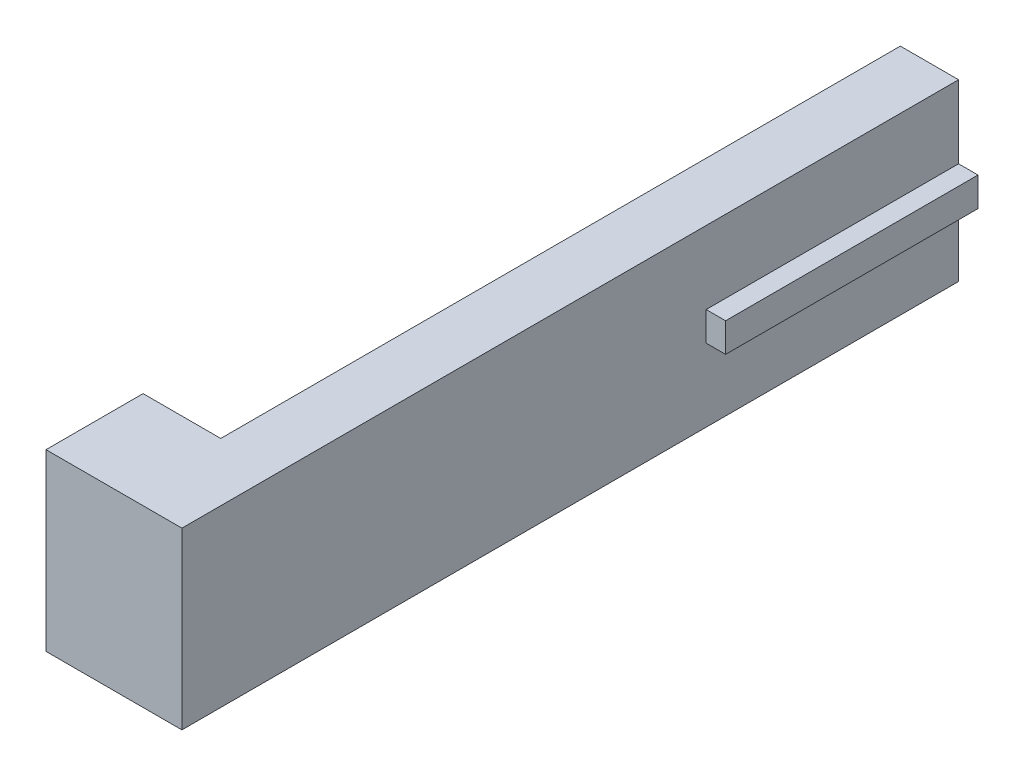
ISO-10303-21;
HEADER;
FILE_DESCRIPTION(('STEP AP214'),'2;1');
FILE_NAME('part.step','',(''),(''),'','','');
FILE_SCHEMA(('AUTOMOTIVE_DESIGN { 1 0 10303 214 1 1 1 1 }'));
ENDSEC;
DATA;
#1=APPLICATION_CONTEXT('core data for automotive mechanical design processes');
#2=APPLICATION_PROTOCOL_DEFINITION('international standard','automotive_design',2000,#1);
#3=PRODUCT_CONTEXT('',#1,'mechanical');
#4=PRODUCT('Part','Part','',(#3));
#5=PRODUCT_RELATED_PRODUCT_CATEGORY('part','',(#4));
#6=PRODUCT_DEFINITION_FORMATION('','',#4);
#7=PRODUCT_DEFINITION_CONTEXT('part definition',#1,'design');
#8=PRODUCT_DEFINITION('design','',#6,#7);
#9=PRODUCT_DEFINITION_SHAPE('','',#8);
#10=(LENGTH_UNIT() NAMED_UNIT(*) SI_UNIT(.MILLI.,.METRE.));
#11=(NAMED_UNIT(*) PLANE_ANGLE_UNIT() SI_UNIT($,.RADIAN.));
#12=(NAMED_UNIT(*) SI_UNIT($,.STERADIAN.) SOLID_ANGLE_UNIT());
#13=UNCERTAINTY_MEASURE_WITH_UNIT(LENGTH_MEASURE(1.E-05),#10,'distance_accuracy_value','');
#14=(GEOMETRIC_REPRESENTATION_CONTEXT(3) GLOBAL_UNCERTAINTY_ASSIGNED_CONTEXT((#13)) GLOBAL_UNIT_ASSIGNED_CONTEXT((#10,
#11,#12)) REPRESENTATION_CONTEXT('',''));
#15=CARTESIAN_POINT('',(0.,0.,0.));
#16=DIRECTION('',(0.,0.,1.));
#17=DIRECTION('',(1.,0.,0.));
#18=AXIS2_PLACEMENT_3D('',#15,#16,#17);
#19=CARTESIAN_POINT('',(-15.,-22.5,200.));
#20=DIRECTION('',(1.,0.,0.));
#21=DIRECTION('',(0.,1.,0.));
#22=AXIS2_PLACEMENT_3D('',#19,#20,#21);
#23=PLANE('',#22);
#24=DIRECTION('',(0.,1.,0.));
#25=VECTOR('',#24,1.);
#26=CARTESIAN_POINT('',(-15.,-22.5,175.));
#27=LINE('',#26,#25);
#28=CARTESIAN_POINT('',(-15.,-22.5,175.));
#29=VERTEX_POINT('',#28);
#30=CARTESIAN_POINT('',(-15.,-3.75000000000001,175.));
#31=VERTEX_POINT('',#30);
#32=EDGE_CURVE('E238',#29,#31,#27,.T.);
#33=ORIENTED_EDGE('',*,*,#32,.T.);
#34=DIRECTION('',(0.,0.,-1.));
#35=VECTOR('',#34,1.);
#36=CARTESIAN_POINT('',(-15.,-3.75,184.01387818866));
#37=LINE('',#36,#35);
#38=CARTESIAN_POINT('',(-15.,-3.75,0.));
#39=VERTEX_POINT('',#38);
#40=EDGE_CURVE('E54',#31,#39,#37,.T.);
#41=ORIENTED_EDGE('',*,*,#40,.T.);
#42=DIRECTION('',(0.,-1.,0.));
#43=VECTOR('',#42,1.);
#44=CARTESIAN_POINT('',(-15.,-22.5,0.));
#45=LINE('',#44,#43);
#46=CARTESIAN_POINT('',(-15.,-22.5,0.));
#47=VERTEX_POINT('',#46);
#48=EDGE_CURVE('E164',#39,#47,#45,.T.);
#49=ORIENTED_EDGE('',*,*,#48,.T.);
#50=DIRECTION('',(0.,0.,-1.));
#51=VECTOR('',#50,1.);
#52=CARTESIAN_POINT('',(-15.,-22.5,200.));
#53=LINE('',#52,#51);
#54=EDGE_CURVE('E196',#29,#47,#53,.T.);
#55=ORIENTED_EDGE('',*,*,#54,.F.);
#56=EDGE_LOOP('',(#33,#41,#49,#55));
#57=FACE_BOUND('',#56,.T.);
#58=ADVANCED_FACE('F39',(#57),#23,.F.);
#59=CARTESIAN_POINT('',(-15.,22.5,200.));
#60=DIRECTION('',(0.,-1.,0.));
#61=DIRECTION('',(0.,0.,-1.));
#62=AXIS2_PLACEMENT_3D('',#59,#60,#61);
#63=PLANE('',#62);
#64=DIRECTION('',(-1.,0.,0.));
#65=VECTOR('',#64,1.);
#66=CARTESIAN_POINT('',(-15.,22.5,0.));
#67=LINE('',#66,#65);
#68=CARTESIAN_POINT('',(0.,22.5,0.));
#69=VERTEX_POINT('',#68);
#70=CARTESIAN_POINT('',(-15.,22.5,0.));
#71=VERTEX_POINT('',#70);
#72=EDGE_CURVE('E168',#69,#71,#67,.T.);
#73=ORIENTED_EDGE('',*,*,#72,.T.);
#74=DIRECTION('',(0.,0.,-1.));
#75=VECTOR('',#74,1.);
#76=CARTESIAN_POINT('',(-15.,22.5,200.));
#77=LINE('',#76,#75);
#78=CARTESIAN_POINT('',(-15.,22.5,175.));
#79=VERTEX_POINT('',#78);
#80=EDGE_CURVE('E47',#79,#71,#77,.T.);
#81=ORIENTED_EDGE('',*,*,#80,.F.);
#82=DIRECTION('',(-1.,0.,0.));
#83=VECTOR('',#82,1.);
#84=CARTESIAN_POINT('',(-35.,22.5,175.));
#85=LINE('',#84,#83);
#86=CARTESIAN_POINT('',(-35.,22.5,175.));
#87=VERTEX_POINT('',#86);
#88=EDGE_CURVE('E428',#79,#87,#85,.T.);
#89=ORIENTED_EDGE('',*,*,#88,.T.);
#90=DIRECTION('',(0.,0.,1.));
#91=VECTOR('',#90,1.);
#92=CARTESIAN_POINT('',(-35.,22.5,175.));
#93=LINE('',#92,#91);
#94=CARTESIAN_POINT('',(-35.,22.5,200.));
#95=VERTEX_POINT('',#94);
#96=EDGE_CURVE('E233',#87,#95,#93,.T.);
#97=ORIENTED_EDGE('',*,*,#96,.T.);
#98=DIRECTION('',(-1.,0.,0.));
#99=VECTOR('',#98,1.);
#100=CARTESIAN_POINT('',(-15.,22.5,200.));
#101=LINE('',#100,#99);
#102=CARTESIAN_POINT('',(0.,22.5,200.));
#103=VERTEX_POINT('',#102);
#104=EDGE_CURVE('E224',#103,#95,#101,.T.);
#105=ORIENTED_EDGE('',*,*,#104,.F.);
#106=DIRECTION('',(0.,0.,-1.));
#107=VECTOR('',#106,1.);
#108=CARTESIAN_POINT('',(0.,22.5,200.));
#109=LINE('',#108,#107);
#110=EDGE_CURVE('E11',#103,#69,#109,.T.);
#111=ORIENTED_EDGE('',*,*,#110,.T.);
#112=EDGE_LOOP('',(#73,#81,#89,#97,#105,#111));
#113=FACE_BOUND('',#112,.T.);
#114=ADVANCED_FACE('F41',(#113),#63,.F.);
#115=CARTESIAN_POINT('',(-15.,3.75,0.));
#116=VERTEX_POINT('',#115);
#117=EDGE_CURVE('E156',#71,#116,#45,.T.);
#118=ORIENTED_EDGE('',*,*,#117,.T.);
#119=DIRECTION('',(0.,0.,-1.));
#120=VECTOR('',#119,1.);
#121=CARTESIAN_POINT('',(-15.,3.75,184.01387818866));
#122=LINE('',#121,#120);
#123=CARTESIAN_POINT('',(-15.,3.75,175.));
#124=VERTEX_POINT('',#123);
#125=EDGE_CURVE('E140',#124,#116,#122,.T.);
#126=ORIENTED_EDGE('',*,*,#125,.F.);
#127=EDGE_CURVE('E62',#124,#79,#27,.T.);
#128=ORIENTED_EDGE('',*,*,#127,.T.);
#129=ORIENTED_EDGE('',*,*,#80,.T.);
#130=EDGE_LOOP('',(#118,#126,#128,#129));
#131=FACE_BOUND('',#130,.T.);
#132=ADVANCED_FACE('F160',(#131),#23,.F.);
#133=CARTESIAN_POINT('',(-15.,-22.5,200.));
#134=DIRECTION('',(0.,1.,0.));
#135=DIRECTION('',(-1.,0.,0.));
#136=AXIS2_PLACEMENT_3D('',#133,#134,#135);
#137=PLANE('',#136);
#138=DIRECTION('',(1.,0.,0.));
#139=VECTOR('',#138,1.);
#140=CARTESIAN_POINT('',(-15.,-22.5,0.));
#141=LINE('',#140,#139);
#142=CARTESIAN_POINT('',(0.,-22.5,0.));
#143=VERTEX_POINT('',#142);
#144=EDGE_CURVE('E163',#47,#143,#141,.T.);
#145=ORIENTED_EDGE('',*,*,#144,.T.);
#146=DIRECTION('',(0.,0.,-1.));
#147=VECTOR('',#146,1.);
#148=CARTESIAN_POINT('',(0.,-22.5,200.));
#149=LINE('',#148,#147);
#150=CARTESIAN_POINT('',(0.,-22.5,200.));
#151=VERTEX_POINT('',#150);
#152=EDGE_CURVE('E193',#151,#143,#149,.T.);
#153=ORIENTED_EDGE('',*,*,#152,.F.);
#154=DIRECTION('',(1.,0.,0.));
#155=VECTOR('',#154,1.);
#156=CARTESIAN_POINT('',(-15.,-22.5,200.));
#157=LINE('',#156,#155);
#158=CARTESIAN_POINT('',(-35.,-22.5,200.));
#159=VERTEX_POINT('',#158);
#160=EDGE_CURVE('E187',#159,#151,#157,.T.);
#161=ORIENTED_EDGE('',*,*,#160,.F.);
#162=DIRECTION('',(0.,0.,1.));
#163=VECTOR('',#162,1.);
#164=CARTESIAN_POINT('',(-35.,-22.5,175.));
#165=LINE('',#164,#163);
#166=CARTESIAN_POINT('',(-35.,-22.5,175.));
#167=VERTEX_POINT('',#166);
#168=EDGE_CURVE('E220',#167,#159,#165,.T.);
#169=ORIENTED_EDGE('',*,*,#168,.F.);
#170=DIRECTION('',(1.,0.,0.));
#171=VECTOR('',#170,1.);
#172=CARTESIAN_POINT('',(-35.,-22.5,175.));
#173=LINE('',#172,#171);
#174=EDGE_CURVE('E205',#167,#29,#173,.T.);
#175=ORIENTED_EDGE('',*,*,#174,.T.);
#176=ORIENTED_EDGE('',*,*,#54,.T.);
#177=EDGE_LOOP('',(#145,#153,#161,#169,#175,#176));
#178=FACE_BOUND('',#177,.T.);
#179=ADVANCED_FACE('F202',(#178),#137,.F.);
#180=CARTESIAN_POINT('',(0.,-22.5,200.));
#181=DIRECTION('',(-1.,0.,0.));
#182=DIRECTION('',(0.,-1.,0.));
#183=AXIS2_PLACEMENT_3D('',#180,#181,#182);
#184=PLANE('',#183);
#185=DIRECTION('',(0.,1.,0.));
#186=VECTOR('',#185,1.);
#187=CARTESIAN_POINT('',(0.,-22.5,0.));
#188=LINE('',#187,#186);
#189=CARTESIAN_POINT('',(0.,-3.75,0.));
#190=VERTEX_POINT('',#189);
#191=EDGE_CURVE('E166',#143,#190,#188,.T.);
#192=ORIENTED_EDGE('',*,*,#191,.T.);
#193=DIRECTION('',(0.,0.,-1.));
#194=VECTOR('',#193,1.);
#195=CARTESIAN_POINT('',(0.,-3.75,200.));
#196=LINE('',#195,#194);
#197=CARTESIAN_POINT('',(0.,-3.75,65.));
#198=VERTEX_POINT('',#197);
#199=EDGE_CURVE('E191',#198,#190,#196,.T.);
#200=ORIENTED_EDGE('',*,*,#199,.F.);
#201=DIRECTION('',(0.,1.,0.));
#202=VECTOR('',#201,1.);
#203=CARTESIAN_POINT('',(0.,3.75,65.));
#204=LINE('',#203,#202);
#205=CARTESIAN_POINT('',(0.,3.75,65.));
#206=VERTEX_POINT('',#205);
#207=EDGE_CURVE('E248',#198,#206,#204,.T.);
#208=ORIENTED_EDGE('',*,*,#207,.T.);
#209=DIRECTION('',(0.,0.,-1.));
#210=VECTOR('',#209,1.);
#211=CARTESIAN_POINT('',(0.,3.75,200.));
#212=LINE('',#211,#210);
#213=CARTESIAN_POINT('',(0.,3.75,0.));
#214=VERTEX_POINT('',#213);
#215=EDGE_CURVE('E184',#206,#214,#212,.T.);
#216=ORIENTED_EDGE('',*,*,#215,.T.);
#217=DIRECTION('',(0.,1.,0.));
#218=VECTOR('',#217,1.);
#219=CARTESIAN_POINT('',(0.,3.75,0.));
#220=LINE('',#219,#218);
#221=EDGE_CURVE('E253',#214,#69,#220,.T.);
#222=ORIENTED_EDGE('',*,*,#221,.T.);
#223=ORIENTED_EDGE('',*,*,#110,.F.);
#224=DIRECTION('',(0.,1.,0.));
#225=VECTOR('',#224,1.);
#226=CARTESIAN_POINT('',(0.,3.75,200.));
#227=LINE('',#226,#225);
#228=EDGE_CURVE('E183',#151,#103,#227,.T.);
#229=ORIENTED_EDGE('',*,*,#228,.F.);
#230=ORIENTED_EDGE('',*,*,#152,.T.);
#231=EDGE_LOOP('',(#192,#200,#208,#216,#222,#223,#229,#230));
#232=FACE_BOUND('',#231,.T.);
#233=ADVANCED_FACE('F214',(#232),#184,.F.);
#234=CARTESIAN_POINT('',(5.,-3.75,200.));
#235=DIRECTION('',(0.,1.,0.));
#236=DIRECTION('',(0.,0.,1.));
#237=AXIS2_PLACEMENT_3D('',#234,#235,#236);
#238=PLANE('',#237);
#239=DIRECTION('',(0.,0.,-1.));
#240=VECTOR('',#239,1.);
#241=CARTESIAN_POINT('',(5.,-3.75,200.));
#242=LINE('',#241,#240);
#243=CARTESIAN_POINT('',(5.,-3.75,65.));
#244=VERTEX_POINT('',#243);
#245=CARTESIAN_POINT('',(5.,-3.75,0.));
#246=VERTEX_POINT('',#245);
#247=EDGE_CURVE('E189',#244,#246,#242,.T.);
#248=ORIENTED_EDGE('',*,*,#247,.F.);
#249=DIRECTION('',(1.,0.,0.));
#250=VECTOR('',#249,1.);
#251=CARTESIAN_POINT('',(-135.2081728299,-3.75,65.));
#252=LINE('',#251,#250);
#253=EDGE_CURVE('E247',#198,#244,#252,.T.);
#254=ORIENTED_EDGE('',*,*,#253,.F.);
#255=ORIENTED_EDGE('',*,*,#199,.T.);
#256=DIRECTION('',(1.,0.,0.));
#257=VECTOR('',#256,1.);
#258=CARTESIAN_POINT('',(5.,-3.75,0.));
#259=LINE('',#258,#257);
#260=EDGE_CURVE('E174',#190,#246,#259,.T.);
#261=ORIENTED_EDGE('',*,*,#260,.T.);
#262=EDGE_LOOP('',(#248,#254,#255,#261));
#263=FACE_BOUND('',#262,.T.);
#264=ADVANCED_FACE('F271',(#263),#238,.F.);
#265=CARTESIAN_POINT('',(5.,-3.75,200.));
#266=DIRECTION('',(-1.,0.,0.));
#267=DIRECTION('',(0.,0.,1.));
#268=AXIS2_PLACEMENT_3D('',#265,#266,#267);
#269=PLANE('',#268);
#270=DIRECTION('',(0.,0.,-1.));
#271=VECTOR('',#270,1.);
#272=CARTESIAN_POINT('',(5.,3.75,200.));
#273=LINE('',#272,#271);
#274=CARTESIAN_POINT('',(5.,3.75,65.));
#275=VERTEX_POINT('',#274);
#276=CARTESIAN_POINT('',(5.,3.75,0.));
#277=VERTEX_POINT('',#276);
#278=EDGE_CURVE('E186',#275,#277,#273,.T.);
#279=ORIENTED_EDGE('',*,*,#278,.F.);
#280=DIRECTION('',(0.,1.,0.));
#281=VECTOR('',#280,1.);
#282=CARTESIAN_POINT('',(5.,3.75,65.));
#283=LINE('',#282,#281);
#284=EDGE_CURVE('E232',#244,#275,#283,.T.);
#285=ORIENTED_EDGE('',*,*,#284,.F.);
#286=ORIENTED_EDGE('',*,*,#247,.T.);
#287=DIRECTION('',(0.,1.,0.));
#288=VECTOR('',#287,1.);
#289=CARTESIAN_POINT('',(5.,-3.75,0.));
#290=LINE('',#289,#288);
#291=EDGE_CURVE('E177',#246,#277,#290,.T.);
#292=ORIENTED_EDGE('',*,*,#291,.T.);
#293=EDGE_LOOP('',(#279,#285,#286,#292));
#294=FACE_BOUND('',#293,.T.);
#295=ADVANCED_FACE('F267',(#294),#269,.F.);
#296=CARTESIAN_POINT('',(5.,3.75,200.));
#297=DIRECTION('',(0.,-1.,0.));
#298=DIRECTION('',(0.,0.,-1.));
#299=AXIS2_PLACEMENT_3D('',#296,#297,#298);
#300=PLANE('',#299);
#301=ORIENTED_EDGE('',*,*,#215,.F.);
#302=DIRECTION('',(1.,0.,0.));
#303=VECTOR('',#302,1.);
#304=CARTESIAN_POINT('',(-135.2081728299,3.75,65.));
#305=LINE('',#304,#303);
#306=EDGE_CURVE('E250',#206,#275,#305,.T.);
#307=ORIENTED_EDGE('',*,*,#306,.T.);
#308=ORIENTED_EDGE('',*,*,#278,.T.);
#309=DIRECTION('',(-1.,0.,0.));
#310=VECTOR('',#309,1.);
#311=CARTESIAN_POINT('',(5.,3.75,0.));
#312=LINE('',#311,#310);
#313=EDGE_CURVE('E180',#277,#214,#312,.T.);
#314=ORIENTED_EDGE('',*,*,#313,.T.);
#315=EDGE_LOOP('',(#301,#307,#308,#314));
#316=FACE_BOUND('',#315,.T.);
#317=ADVANCED_FACE('F263',(#316),#300,.F.);
#318=CARTESIAN_POINT('',(0.,0.,200.));
#319=DIRECTION('',(0.,0.,-1.));
#320=DIRECTION('',(-1.,0.,0.));
#321=AXIS2_PLACEMENT_3D('',#318,#319,#320);
#322=PLANE('',#321);
#323=ORIENTED_EDGE('',*,*,#160,.T.);
#324=ORIENTED_EDGE('',*,*,#228,.T.);
#325=ORIENTED_EDGE('',*,*,#104,.T.);
#326=DIRECTION('',(0.,-1.,0.));
#327=VECTOR('',#326,1.);
#328=CARTESIAN_POINT('',(-35.,-22.5,200.));
#329=LINE('',#328,#327);
#330=EDGE_CURVE('E229',#95,#159,#329,.T.);
#331=ORIENTED_EDGE('',*,*,#330,.T.);
#332=EDGE_LOOP('',(#323,#324,#325,#331));
#333=FACE_BOUND('',#332,.T.);
#334=ADVANCED_FACE('F235',(#333),#322,.F.);
#335=CARTESIAN_POINT('',(0.,0.,0.));
#336=DIRECTION('',(0.,0.,-1.));
#337=DIRECTION('',(-1.,0.,0.));
#338=AXIS2_PLACEMENT_3D('',#335,#336,#337);
#339=PLANE('',#338);
#340=DIRECTION('',(-1.,0.,0.));
#341=VECTOR('',#340,1.);
#342=CARTESIAN_POINT('',(-10.,-3.75,0.));
#343=LINE('',#342,#341);
#344=CARTESIAN_POINT('',(-10.,-3.75,0.));
#345=VERTEX_POINT('',#344);
#346=EDGE_CURVE('E150',#345,#39,#343,.T.);
#347=ORIENTED_EDGE('',*,*,#346,.F.);
#348=DIRECTION('',(0.,-1.,0.));
#349=VECTOR('',#348,1.);
#350=CARTESIAN_POINT('',(-10.,-3.75,0.));
#351=LINE('',#350,#349);
#352=CARTESIAN_POINT('',(-10.,3.75,0.));
#353=VERTEX_POINT('',#352);
#354=EDGE_CURVE('E158',#353,#345,#351,.T.);
#355=ORIENTED_EDGE('',*,*,#354,.F.);
#356=DIRECTION('',(1.,0.,0.));
#357=VECTOR('',#356,1.);
#358=CARTESIAN_POINT('',(-10.,3.75,0.));
#359=LINE('',#358,#357);
#360=EDGE_CURVE('E144',#116,#353,#359,.T.);
#361=ORIENTED_EDGE('',*,*,#360,.F.);
#362=ORIENTED_EDGE('',*,*,#117,.F.);
#363=ORIENTED_EDGE('',*,*,#72,.F.);
#364=ORIENTED_EDGE('',*,*,#221,.F.);
#365=ORIENTED_EDGE('',*,*,#313,.F.);
#366=ORIENTED_EDGE('',*,*,#291,.F.);
#367=ORIENTED_EDGE('',*,*,#260,.F.);
#368=ORIENTED_EDGE('',*,*,#191,.F.);
#369=ORIENTED_EDGE('',*,*,#144,.F.);
#370=ORIENTED_EDGE('',*,*,#48,.F.);
#371=EDGE_LOOP('',(#347,#355,#361,#362,#363,#364,#365,#366,#367,#368,#369,#370));
#372=FACE_BOUND('',#371,.T.);
#373=ADVANCED_FACE('F155',(#372),#339,.T.);
#374=CARTESIAN_POINT('',(-135.2081728299,3.75,65.));
#375=DIRECTION('',(0.,0.,-1.));
#376=DIRECTION('',(-1.,0.,0.));
#377=AXIS2_PLACEMENT_3D('',#374,#375,#376);
#378=PLANE('',#377);
#379=ORIENTED_EDGE('',*,*,#253,.T.);
#380=ORIENTED_EDGE('',*,*,#284,.T.);
#381=ORIENTED_EDGE('',*,*,#306,.F.);
#382=ORIENTED_EDGE('',*,*,#207,.F.);
#383=EDGE_LOOP('',(#379,#380,#381,#382));
#384=FACE_BOUND('',#383,.T.);
#385=ADVANCED_FACE('F273',(#384),#378,.F.);
#386=CARTESIAN_POINT('',(-35.,-22.5,175.));
#387=DIRECTION('',(-1.,0.,0.));
#388=DIRECTION('',(0.,0.,1.));
#389=AXIS2_PLACEMENT_3D('',#386,#387,#388);
#390=PLANE('',#389);
#391=ORIENTED_EDGE('',*,*,#330,.F.);
#392=ORIENTED_EDGE('',*,*,#96,.F.);
#393=DIRECTION('',(0.,-1.,0.));
#394=VECTOR('',#393,1.);
#395=CARTESIAN_POINT('',(-35.,-22.5,175.));
#396=LINE('',#395,#394);
#397=EDGE_CURVE('E231',#87,#167,#396,.T.);
#398=ORIENTED_EDGE('',*,*,#397,.T.);
#399=ORIENTED_EDGE('',*,*,#168,.T.);
#400=EDGE_LOOP('',(#391,#392,#398,#399));
#401=FACE_BOUND('',#400,.T.);
#402=ADVANCED_FACE('F228',(#401),#390,.T.);
#403=CARTESIAN_POINT('',(0.,0.,175.));
#404=DIRECTION('',(0.,0.,-1.));
#405=DIRECTION('',(-1.,0.,0.));
#406=AXIS2_PLACEMENT_3D('',#403,#404,#405);
#407=PLANE('',#406);
#408=ORIENTED_EDGE('',*,*,#32,.F.);
#409=ORIENTED_EDGE('',*,*,#174,.F.);
#410=ORIENTED_EDGE('',*,*,#397,.F.);
#411=ORIENTED_EDGE('',*,*,#88,.F.);
#412=ORIENTED_EDGE('',*,*,#127,.F.);
#413=DIRECTION('',(-1.,0.,0.));
#414=VECTOR('',#413,1.);
#415=CARTESIAN_POINT('',(-10.,3.75,175.));
#416=LINE('',#415,#414);
#417=CARTESIAN_POINT('',(-10.,3.75,175.));
#418=VERTEX_POINT('',#417);
#419=EDGE_CURVE('E147',#418,#124,#416,.T.);
#420=ORIENTED_EDGE('',*,*,#419,.F.);
#421=DIRECTION('',(0.,1.,0.));
#422=VECTOR('',#421,1.);
#423=CARTESIAN_POINT('',(-10.,-3.75,175.));
#424=LINE('',#423,#422);
#425=CARTESIAN_POINT('',(-10.,-3.75,175.));
#426=VERTEX_POINT('',#425);
#427=EDGE_CURVE('E424',#426,#418,#424,.T.);
#428=ORIENTED_EDGE('',*,*,#427,.F.);
#429=DIRECTION('',(1.,0.,0.));
#430=VECTOR('',#429,1.);
#431=CARTESIAN_POINT('',(-10.,-3.75,175.));
#432=LINE('',#431,#430);
#433=EDGE_CURVE('E240',#31,#426,#432,.T.);
#434=ORIENTED_EDGE('',*,*,#433,.F.);
#435=EDGE_LOOP('',(#408,#409,#410,#411,#412,#420,#428,#434));
#436=FACE_BOUND('',#435,.T.);
#437=ADVANCED_FACE('F281',(#436),#407,.T.);
#438=CARTESIAN_POINT('',(-10.,-3.75,184.01387818866));
#439=DIRECTION('',(0.,-1.,0.));
#440=DIRECTION('',(1.,0.,0.));
#441=AXIS2_PLACEMENT_3D('',#438,#439,#440);
#442=PLANE('',#441);
#443=ORIENTED_EDGE('',*,*,#433,.T.);
#444=DIRECTION('',(0.,0.,-1.));
#445=VECTOR('',#444,1.);
#446=CARTESIAN_POINT('',(-10.,-3.75,184.01387818866));
#447=LINE('',#446,#445);
#448=EDGE_CURVE('E425',#426,#345,#447,.T.);
#449=ORIENTED_EDGE('',*,*,#448,.T.);
#450=ORIENTED_EDGE('',*,*,#346,.T.);
#451=ORIENTED_EDGE('',*,*,#40,.F.);
#452=EDGE_LOOP('',(#443,#449,#450,#451));
#453=FACE_BOUND('',#452,.T.);
#454=ADVANCED_FACE('F323',(#453),#442,.F.);
#455=CARTESIAN_POINT('',(-10.,-3.75,184.01387818866));
#456=DIRECTION('',(1.,0.,0.));
#457=DIRECTION('',(0.,0.,-1.));
#458=AXIS2_PLACEMENT_3D('',#455,#456,#457);
#459=PLANE('',#458);
#460=ORIENTED_EDGE('',*,*,#427,.T.);
#461=DIRECTION('',(0.,0.,-1.));
#462=VECTOR('',#461,1.);
#463=CARTESIAN_POINT('',(-10.,3.75,184.01387818866));
#464=LINE('',#463,#462);
#465=EDGE_CURVE('E149',#418,#353,#464,.T.);
#466=ORIENTED_EDGE('',*,*,#465,.T.);
#467=ORIENTED_EDGE('',*,*,#354,.T.);
#468=ORIENTED_EDGE('',*,*,#448,.F.);
#469=EDGE_LOOP('',(#460,#466,#467,#468));
#470=FACE_BOUND('',#469,.T.);
#471=ADVANCED_FACE('F337',(#470),#459,.F.);
#472=CARTESIAN_POINT('',(-10.,3.75,184.01387818866));
#473=DIRECTION('',(0.,1.,0.));
#474=DIRECTION('',(0.,0.,1.));
#475=AXIS2_PLACEMENT_3D('',#472,#473,#474);
#476=PLANE('',#475);
#477=ORIENTED_EDGE('',*,*,#419,.T.);
#478=ORIENTED_EDGE('',*,*,#125,.T.);
#479=ORIENTED_EDGE('',*,*,#360,.T.);
#480=ORIENTED_EDGE('',*,*,#465,.F.);
#481=EDGE_LOOP('',(#477,#478,#479,#480));
#482=FACE_BOUND('',#481,.T.);
#483=ADVANCED_FACE('F142',(#482),#476,.F.);
#484=CLOSED_SHELL('',(#58,#114,#132,#179,#233,#264,#295,#317,#334,#373,#385,#402,#437,#454,#471,#483));
#485=MANIFOLD_SOLID_BREP('B2',#484);
#486=ADVANCED_BREP_SHAPE_REPRESENTATION('',(#18,#485),#14);
#487=SHAPE_DEFINITION_REPRESENTATION(#9,#486);
ENDSEC;
END-ISO-10303-21;
